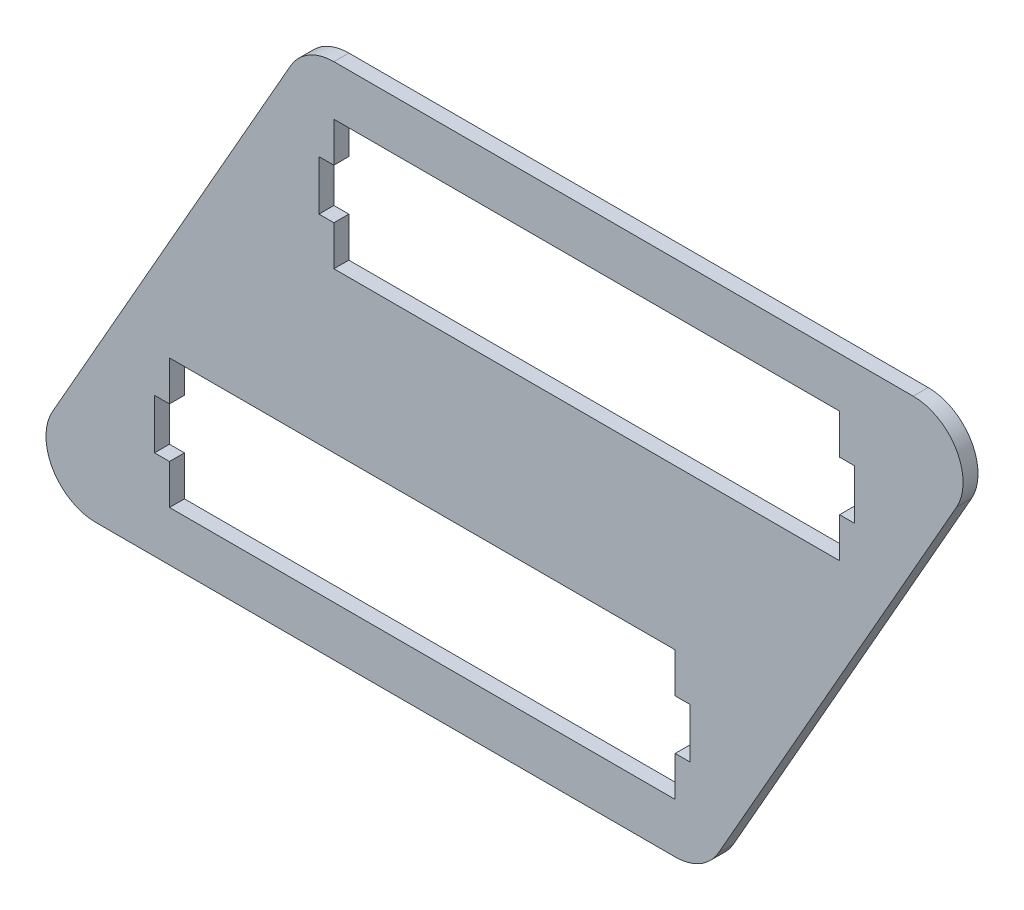
ISO-10303-21;
HEADER;
FILE_DESCRIPTION(('STEP AP214'),'2;1');
FILE_NAME('part.step','',(''),(''),'','','');
FILE_SCHEMA(('AUTOMOTIVE_DESIGN { 1 0 10303 214 1 1 1 1 }'));
ENDSEC;
DATA;
#1=APPLICATION_CONTEXT('core data for automotive mechanical design processes');
#2=APPLICATION_PROTOCOL_DEFINITION('international standard','automotive_design',2000,#1);
#3=PRODUCT_CONTEXT('',#1,'mechanical');
#4=PRODUCT('Part','Part','',(#3));
#5=PRODUCT_RELATED_PRODUCT_CATEGORY('part','',(#4));
#6=PRODUCT_DEFINITION_FORMATION('','',#4);
#7=PRODUCT_DEFINITION_CONTEXT('part definition',#1,'design');
#8=PRODUCT_DEFINITION('design','',#6,#7);
#9=PRODUCT_DEFINITION_SHAPE('','',#8);
#10=(LENGTH_UNIT() NAMED_UNIT(*) SI_UNIT(.MILLI.,.METRE.));
#11=(NAMED_UNIT(*) PLANE_ANGLE_UNIT() SI_UNIT($,.RADIAN.));
#12=(NAMED_UNIT(*) SI_UNIT($,.STERADIAN.) SOLID_ANGLE_UNIT());
#13=UNCERTAINTY_MEASURE_WITH_UNIT(LENGTH_MEASURE(1.E-05),#10,'distance_accuracy_value','');
#14=(GEOMETRIC_REPRESENTATION_CONTEXT(3) GLOBAL_UNCERTAINTY_ASSIGNED_CONTEXT((#13)) GLOBAL_UNIT_ASSIGNED_CONTEXT((#10,
#11,#12)) REPRESENTATION_CONTEXT('',''));
#15=CARTESIAN_POINT('',(0.,0.,0.));
#16=DIRECTION('',(0.,0.,1.));
#17=DIRECTION('',(1.,0.,0.));
#18=AXIS2_PLACEMENT_3D('',#15,#16,#17);
#19=CARTESIAN_POINT('',(133.488069393588,10.0000000000001,3.));
#20=DIRECTION('',(-1.,0.,0.));
#21=DIRECTION('',(0.,0.,1.));
#22=AXIS2_PLACEMENT_3D('',#19,#20,#21);
#23=PLANE('',#22);
#24=DIRECTION('',(0.,0.,1.));
#25=VECTOR('',#24,1.);
#26=CARTESIAN_POINT('',(133.488069393588,28.0000000000001,-0.00100000000000013));
#27=LINE('',#26,#25);
#28=CARTESIAN_POINT('',(133.488069393588,28.0000000000001,0.));
#29=VERTEX_POINT('',#28);
#30=CARTESIAN_POINT('',(133.488069393588,28.0000000000001,3.));
#31=VERTEX_POINT('',#30);
#32=EDGE_CURVE('E240',#29,#31,#27,.T.);
#33=ORIENTED_EDGE('',*,*,#32,.T.);
#34=DIRECTION('',(0.,1.,0.));
#35=VECTOR('',#34,1.);
#36=CARTESIAN_POINT('',(133.488069393588,10.0000000000001,3.));
#37=LINE('',#36,#35);
#38=CARTESIAN_POINT('',(133.488069393588,36.0000000000001,3.));
#39=VERTEX_POINT('',#38);
#40=EDGE_CURVE('E477',#31,#39,#37,.T.);
#41=ORIENTED_EDGE('',*,*,#40,.T.);
#42=DIRECTION('',(0.,0.,-1.));
#43=VECTOR('',#42,1.);
#44=CARTESIAN_POINT('',(133.488069393588,36.0000000000001,3.));
#45=LINE('',#44,#43);
#46=CARTESIAN_POINT('',(133.488069393588,36.0000000000001,0.));
#47=VERTEX_POINT('',#46);
#48=EDGE_CURVE('E262',#39,#47,#45,.T.);
#49=ORIENTED_EDGE('',*,*,#48,.T.);
#50=DIRECTION('',(0.,1.,0.));
#51=VECTOR('',#50,1.);
#52=CARTESIAN_POINT('',(133.488069393588,10.0000000000001,0.));
#53=LINE('',#52,#51);
#54=EDGE_CURVE('E256',#29,#47,#53,.T.);
#55=ORIENTED_EDGE('',*,*,#54,.F.);
#56=EDGE_LOOP('',(#33,#41,#49,#55));
#57=FACE_BOUND('',#56,.T.);
#58=ADVANCED_FACE('F32',(#57),#23,.T.);
#59=CARTESIAN_POINT('',(31.9880693935882,10.,3.));
#60=DIRECTION('',(1.,0.,0.));
#61=DIRECTION('',(0.,1.,0.));
#62=AXIS2_PLACEMENT_3D('',#59,#60,#61);
#63=PLANE('',#62);
#64=DIRECTION('',(0.,0.,1.));
#65=VECTOR('',#64,1.);
#66=CARTESIAN_POINT('',(31.9880693935882,18.,-0.00100000000000013));
#67=LINE('',#66,#65);
#68=CARTESIAN_POINT('',(31.9880693935882,18.,0.));
#69=VERTEX_POINT('',#68);
#70=CARTESIAN_POINT('',(31.9880693935882,18.,3.));
#71=VERTEX_POINT('',#70);
#72=EDGE_CURVE('E465',#69,#71,#67,.T.);
#73=ORIENTED_EDGE('',*,*,#72,.T.);
#74=DIRECTION('',(0.,-1.,0.));
#75=VECTOR('',#74,1.);
#76=CARTESIAN_POINT('',(31.9880693935882,10.,3.));
#77=LINE('',#76,#75);
#78=CARTESIAN_POINT('',(31.9880693935882,10.,3.));
#79=VERTEX_POINT('',#78);
#80=EDGE_CURVE('E275',#71,#79,#77,.T.);
#81=ORIENTED_EDGE('',*,*,#80,.T.);
#82=DIRECTION('',(0.,0.,-1.));
#83=VECTOR('',#82,1.);
#84=CARTESIAN_POINT('',(31.9880693935882,10.,3.));
#85=LINE('',#84,#83);
#86=CARTESIAN_POINT('',(31.9880693935882,10.,0.));
#87=VERTEX_POINT('',#86);
#88=EDGE_CURVE('E283',#79,#87,#85,.T.);
#89=ORIENTED_EDGE('',*,*,#88,.T.);
#90=DIRECTION('',(0.,-1.,0.));
#91=VECTOR('',#90,1.);
#92=CARTESIAN_POINT('',(31.9880693935882,10.,0.));
#93=LINE('',#92,#91);
#94=EDGE_CURVE('E460',#69,#87,#93,.T.);
#95=ORIENTED_EDGE('',*,*,#94,.F.);
#96=EDGE_LOOP('',(#73,#81,#89,#95));
#97=FACE_BOUND('',#96,.T.);
#98=ADVANCED_FACE('F426',(#97),#63,.T.);
#99=CARTESIAN_POINT('',(166.488069393588,68.0000000000001,3.));
#100=DIRECTION('',(-1.,0.,0.));
#101=DIRECTION('',(0.,0.,1.));
#102=AXIS2_PLACEMENT_3D('',#99,#100,#101);
#103=PLANE('',#102);
#104=DIRECTION('',(0.,0.,1.));
#105=VECTOR('',#104,1.);
#106=CARTESIAN_POINT('',(166.488069393588,86.,-0.00100000000000013));
#107=LINE('',#106,#105);
#108=CARTESIAN_POINT('',(166.488069393588,86.,0.));
#109=VERTEX_POINT('',#108);
#110=CARTESIAN_POINT('',(166.488069393588,86.,3.));
#111=VERTEX_POINT('',#110);
#112=EDGE_CURVE('E514',#109,#111,#107,.T.);
#113=ORIENTED_EDGE('',*,*,#112,.T.);
#114=DIRECTION('',(0.,1.,0.));
#115=VECTOR('',#114,1.);
#116=CARTESIAN_POINT('',(166.488069393588,68.0000000000001,3.));
#117=LINE('',#116,#115);
#118=CARTESIAN_POINT('',(166.488069393588,94.0000000000001,3.));
#119=VERTEX_POINT('',#118);
#120=EDGE_CURVE('E293',#111,#119,#117,.T.);
#121=ORIENTED_EDGE('',*,*,#120,.T.);
#122=DIRECTION('',(0.,0.,-1.));
#123=VECTOR('',#122,1.);
#124=CARTESIAN_POINT('',(166.488069393588,94.0000000000001,3.));
#125=LINE('',#124,#123);
#126=CARTESIAN_POINT('',(166.488069393588,94.0000000000001,0.));
#127=VERTEX_POINT('',#126);
#128=EDGE_CURVE('E315',#119,#127,#125,.T.);
#129=ORIENTED_EDGE('',*,*,#128,.T.);
#130=DIRECTION('',(0.,1.,0.));
#131=VECTOR('',#130,1.);
#132=CARTESIAN_POINT('',(166.488069393588,68.0000000000001,0.));
#133=LINE('',#132,#131);
#134=EDGE_CURVE('E306',#109,#127,#133,.T.);
#135=ORIENTED_EDGE('',*,*,#134,.F.);
#136=EDGE_LOOP('',(#113,#121,#129,#135));
#137=FACE_BOUND('',#136,.T.);
#138=ADVANCED_FACE('F432',(#137),#103,.T.);
#139=CARTESIAN_POINT('',(64.9880693935882,68.,3.));
#140=DIRECTION('',(1.,0.,0.));
#141=DIRECTION('',(0.,0.,-1.));
#142=AXIS2_PLACEMENT_3D('',#139,#140,#141);
#143=PLANE('',#142);
#144=DIRECTION('',(0.,0.,1.));
#145=VECTOR('',#144,1.);
#146=CARTESIAN_POINT('',(64.9880693935882,76.,-0.00100000000000013));
#147=LINE('',#146,#145);
#148=CARTESIAN_POINT('',(64.9880693935882,76.,0.));
#149=VERTEX_POINT('',#148);
#150=CARTESIAN_POINT('',(64.9880693935882,76.,3.));
#151=VERTEX_POINT('',#150);
#152=EDGE_CURVE('E480',#149,#151,#147,.T.);
#153=ORIENTED_EDGE('',*,*,#152,.T.);
#154=DIRECTION('',(0.,-1.,0.));
#155=VECTOR('',#154,1.);
#156=CARTESIAN_POINT('',(64.9880693935882,68.,3.));
#157=LINE('',#156,#155);
#158=CARTESIAN_POINT('',(64.9880693935882,68.,3.));
#159=VERTEX_POINT('',#158);
#160=EDGE_CURVE('E291',#151,#159,#157,.T.);
#161=ORIENTED_EDGE('',*,*,#160,.T.);
#162=DIRECTION('',(0.,0.,-1.));
#163=VECTOR('',#162,1.);
#164=CARTESIAN_POINT('',(64.9880693935882,68.,3.));
#165=LINE('',#164,#163);
#166=CARTESIAN_POINT('',(64.9880693935882,68.,0.));
#167=VERTEX_POINT('',#166);
#168=EDGE_CURVE('E320',#159,#167,#165,.T.);
#169=ORIENTED_EDGE('',*,*,#168,.T.);
#170=DIRECTION('',(0.,-1.,0.));
#171=VECTOR('',#170,1.);
#172=CARTESIAN_POINT('',(64.9880693935882,68.,0.));
#173=LINE('',#172,#171);
#174=EDGE_CURVE('E286',#149,#167,#173,.T.);
#175=ORIENTED_EDGE('',*,*,#174,.F.);
#176=EDGE_LOOP('',(#153,#161,#169,#175));
#177=FACE_BOUND('',#176,.T.);
#178=ADVANCED_FACE('F701',(#177),#143,.T.);
#179=CARTESIAN_POINT('',(0.,0.,3.));
#180=DIRECTION('',(0.,0.,1.));
#181=DIRECTION('',(1.,0.,0.));
#182=AXIS2_PLACEMENT_3D('',#179,#180,#181);
#183=PLANE('',#182);
#184=DIRECTION('',(-1.,0.,0.));
#185=VECTOR('',#184,1.);
#186=CARTESIAN_POINT('',(136.488069393588,28.,3.));
#187=LINE('',#186,#185);
#188=CARTESIAN_POINT('',(136.488069393588,28.,3.));
#189=VERTEX_POINT('',#188);
#190=EDGE_CURVE('E246',#189,#31,#187,.T.);
#191=ORIENTED_EDGE('',*,*,#190,.F.);
#192=DIRECTION('',(0.,1.,0.));
#193=VECTOR('',#192,1.);
#194=CARTESIAN_POINT('',(136.488069393588,18.,3.));
#195=LINE('',#194,#193);
#196=CARTESIAN_POINT('',(136.488069393588,18.,3.));
#197=VERTEX_POINT('',#196);
#198=EDGE_CURVE('E251',#197,#189,#195,.T.);
#199=ORIENTED_EDGE('',*,*,#198,.F.);
#200=DIRECTION('',(1.,0.,0.));
#201=VECTOR('',#200,1.);
#202=CARTESIAN_POINT('',(133.488069393588,18.,3.));
#203=LINE('',#202,#201);
#204=CARTESIAN_POINT('',(133.488069393588,18.,3.));
#205=VERTEX_POINT('',#204);
#206=EDGE_CURVE('E565',#205,#197,#203,.T.);
#207=ORIENTED_EDGE('',*,*,#206,.F.);
#208=CARTESIAN_POINT('',(133.488069393588,10.0000000000001,3.));
#209=VERTEX_POINT('',#208);
#210=EDGE_CURVE('E452',#209,#205,#37,.T.);
#211=ORIENTED_EDGE('',*,*,#210,.F.);
#212=DIRECTION('',(1.,0.,0.));
#213=VECTOR('',#212,1.);
#214=CARTESIAN_POINT('',(133.488069393588,10.0000000000001,3.));
#215=LINE('',#214,#213);
#216=EDGE_CURVE('E471',#79,#209,#215,.T.);
#217=ORIENTED_EDGE('',*,*,#216,.F.);
#218=ORIENTED_EDGE('',*,*,#80,.F.);
#219=DIRECTION('',(1.,0.,0.));
#220=VECTOR('',#219,1.);
#221=CARTESIAN_POINT('',(31.9880693935882,18.,3.));
#222=LINE('',#221,#220);
#223=CARTESIAN_POINT('',(28.9880693935882,18.,3.));
#224=VERTEX_POINT('',#223);
#225=EDGE_CURVE('E542',#224,#71,#222,.T.);
#226=ORIENTED_EDGE('',*,*,#225,.F.);
#227=DIRECTION('',(0.,-1.,0.));
#228=VECTOR('',#227,1.);
#229=CARTESIAN_POINT('',(28.9880693935882,18.,3.));
#230=LINE('',#229,#228);
#231=CARTESIAN_POINT('',(28.9880693935882,28.,3.));
#232=VERTEX_POINT('',#231);
#233=EDGE_CURVE('E548',#232,#224,#230,.T.);
#234=ORIENTED_EDGE('',*,*,#233,.F.);
#235=DIRECTION('',(-1.,0.,0.));
#236=VECTOR('',#235,1.);
#237=CARTESIAN_POINT('',(28.9880693935882,28.,3.));
#238=LINE('',#237,#236);
#239=CARTESIAN_POINT('',(31.9880693935882,28.0000000000001,3.));
#240=VERTEX_POINT('',#239);
#241=EDGE_CURVE('E551',#240,#232,#238,.T.);
#242=ORIENTED_EDGE('',*,*,#241,.F.);
#243=CARTESIAN_POINT('',(31.9880693935882,36.,3.));
#244=VERTEX_POINT('',#243);
#245=EDGE_CURVE('E468',#244,#240,#77,.T.);
#246=ORIENTED_EDGE('',*,*,#245,.F.);
#247=DIRECTION('',(-1.,0.,0.));
#248=VECTOR('',#247,1.);
#249=CARTESIAN_POINT('',(133.488069393588,36.0000000000001,3.));
#250=LINE('',#249,#248);
#251=EDGE_CURVE('E279',#39,#244,#250,.T.);
#252=ORIENTED_EDGE('',*,*,#251,.F.);
#253=ORIENTED_EDGE('',*,*,#40,.F.);
#254=EDGE_LOOP('',(#191,#199,#207,#211,#217,#218,#226,#234,#242,#246,#252,#253));
#255=FACE_BOUND('',#254,.T.);
#256=DIRECTION('',(-1.,0.,0.));
#257=VECTOR('',#256,1.);
#258=CARTESIAN_POINT('',(169.488069393588,86.,3.));
#259=LINE('',#258,#257);
#260=CARTESIAN_POINT('',(169.488069393588,86.,3.));
#261=VERTEX_POINT('',#260);
#262=EDGE_CURVE('E528',#261,#111,#259,.T.);
#263=ORIENTED_EDGE('',*,*,#262,.F.);
#264=DIRECTION('',(0.,1.,0.));
#265=VECTOR('',#264,1.);
#266=CARTESIAN_POINT('',(169.488069393588,76.,3.));
#267=LINE('',#266,#265);
#268=CARTESIAN_POINT('',(169.488069393588,76.,3.));
#269=VERTEX_POINT('',#268);
#270=EDGE_CURVE('E518',#269,#261,#267,.T.);
#271=ORIENTED_EDGE('',*,*,#270,.F.);
#272=DIRECTION('',(1.,0.,0.));
#273=VECTOR('',#272,1.);
#274=CARTESIAN_POINT('',(166.488069393588,76.,3.));
#275=LINE('',#274,#273);
#276=CARTESIAN_POINT('',(166.488069393588,76.,3.));
#277=VERTEX_POINT('',#276);
#278=EDGE_CURVE('E525',#277,#269,#275,.T.);
#279=ORIENTED_EDGE('',*,*,#278,.F.);
#280=CARTESIAN_POINT('',(166.488069393588,68.0000000000001,3.));
#281=VERTEX_POINT('',#280);
#282=EDGE_CURVE('E294',#281,#277,#117,.T.);
#283=ORIENTED_EDGE('',*,*,#282,.F.);
#284=DIRECTION('',(1.,0.,0.));
#285=VECTOR('',#284,1.);
#286=CARTESIAN_POINT('',(166.488069393588,68.0000000000001,3.));
#287=LINE('',#286,#285);
#288=EDGE_CURVE('E290',#159,#281,#287,.T.);
#289=ORIENTED_EDGE('',*,*,#288,.F.);
#290=ORIENTED_EDGE('',*,*,#160,.F.);
#291=DIRECTION('',(1.,0.,0.));
#292=VECTOR('',#291,1.);
#293=CARTESIAN_POINT('',(64.9880693935882,76.,3.));
#294=LINE('',#293,#292);
#295=CARTESIAN_POINT('',(61.9880693935882,76.,3.));
#296=VERTEX_POINT('',#295);
#297=EDGE_CURVE('E493',#296,#151,#294,.T.);
#298=ORIENTED_EDGE('',*,*,#297,.F.);
#299=DIRECTION('',(0.,-1.,0.));
#300=VECTOR('',#299,1.);
#301=CARTESIAN_POINT('',(61.9880693935882,76.,3.));
#302=LINE('',#301,#300);
#303=CARTESIAN_POINT('',(61.9880693935882,86.,3.));
#304=VERTEX_POINT('',#303);
#305=EDGE_CURVE('E499',#304,#296,#302,.T.);
#306=ORIENTED_EDGE('',*,*,#305,.F.);
#307=DIRECTION('',(-1.,0.,0.));
#308=VECTOR('',#307,1.);
#309=CARTESIAN_POINT('',(61.9880693935882,86.,3.));
#310=LINE('',#309,#308);
#311=CARTESIAN_POINT('',(64.9880693935882,86.,3.));
#312=VERTEX_POINT('',#311);
#313=EDGE_CURVE('E502',#312,#304,#310,.T.);
#314=ORIENTED_EDGE('',*,*,#313,.F.);
#315=CARTESIAN_POINT('',(64.9880693935882,94.,3.));
#316=VERTEX_POINT('',#315);
#317=EDGE_CURVE('E287',#316,#312,#157,.T.);
#318=ORIENTED_EDGE('',*,*,#317,.F.);
#319=DIRECTION('',(-1.,0.,0.));
#320=VECTOR('',#319,1.);
#321=CARTESIAN_POINT('',(166.488069393588,94.0000000000001,3.));
#322=LINE('',#321,#320);
#323=EDGE_CURVE('E297',#119,#316,#322,.T.);
#324=ORIENTED_EDGE('',*,*,#323,.F.);
#325=ORIENTED_EDGE('',*,*,#120,.F.);
#326=EDGE_LOOP('',(#263,#271,#279,#283,#289,#290,#298,#306,#314,#318,#324,#325));
#327=FACE_BOUND('',#326,.T.);
#328=DIRECTION('',(-0.494524249255059,-0.869163832024044,0.));
#329=VECTOR('',#328,1.);
#330=CARTESIAN_POINT('',(0.,0.,3.));
#331=LINE('',#330,#329);
#332=CARTESIAN_POINT('',(56.2964310733478,98.9452424925506,3.));
#333=VERTEX_POINT('',#332);
#334=CARTESIAN_POINT('',(8.50332762507188,14.9452424925506,3.));
#335=VERTEX_POINT('',#334);
#336=EDGE_CURVE('E334',#333,#335,#331,.T.);
#337=ORIENTED_EDGE('',*,*,#336,.T.);
#338=CARTESIAN_POINT('',(17.1949659453123,10.,3.));
#339=DIRECTION('',(0.,0.,1.));
#340=DIRECTION('',(1.,0.,0.));
#341=AXIS2_PLACEMENT_3D('',#338,#339,#340);
#342=CIRCLE('',#341,10.);
#343=CARTESIAN_POINT('',(17.1949659453123,0.,3.));
#344=VERTEX_POINT('',#343);
#345=EDGE_CURVE('E371',#335,#344,#342,.T.);
#346=ORIENTED_EDGE('',*,*,#345,.T.);
#347=DIRECTION('',(1.,0.,0.));
#348=VECTOR('',#347,1.);
#349=CARTESIAN_POINT('',(0.,0.,3.));
#350=LINE('',#349,#348);
#351=CARTESIAN_POINT('',(133.488069393588,0.,3.));
#352=VERTEX_POINT('',#351);
#353=EDGE_CURVE('E324',#344,#352,#350,.T.);
#354=ORIENTED_EDGE('',*,*,#353,.T.);
#355=CARTESIAN_POINT('',(133.488069393588,10.,3.));
#356=DIRECTION('',(0.,0.,1.));
#357=DIRECTION('',(1.,0.,0.));
#358=AXIS2_PLACEMENT_3D('',#355,#356,#357);
#359=CIRCLE('',#358,10.);
#360=CARTESIAN_POINT('',(142.179707713829,5.0547575074494,3.));
#361=VERTEX_POINT('',#360);
#362=EDGE_CURVE('E369',#352,#361,#359,.T.);
#363=ORIENTED_EDGE('',*,*,#362,.T.);
#364=DIRECTION('',(0.494524249255059,0.869163832024043,0.));
#365=VECTOR('',#364,1.);
#366=CARTESIAN_POINT('',(139.303724994073,0.,3.));
#367=LINE('',#366,#365);
#368=CARTESIAN_POINT('',(189.972811162105,89.0547575074494,3.));
#369=VERTEX_POINT('',#368);
#370=EDGE_CURVE('E327',#361,#369,#367,.T.);
#371=ORIENTED_EDGE('',*,*,#370,.T.);
#372=CARTESIAN_POINT('',(181.281172841864,94.0000000000001,3.));
#373=DIRECTION('',(0.,0.,1.));
#374=DIRECTION('',(1.,0.,0.));
#375=AXIS2_PLACEMENT_3D('',#372,#373,#374);
#376=CIRCLE('',#375,10.);
#377=CARTESIAN_POINT('',(181.281172841864,104.,3.));
#378=VERTEX_POINT('',#377);
#379=EDGE_CURVE('E365',#369,#378,#376,.T.);
#380=ORIENTED_EDGE('',*,*,#379,.T.);
#381=DIRECTION('',(-1.,0.,0.));
#382=VECTOR('',#381,1.);
#383=CARTESIAN_POINT('',(59.1724137931035,104.,3.));
#384=LINE('',#383,#382);
#385=CARTESIAN_POINT('',(64.9880693935882,104.,3.));
#386=VERTEX_POINT('',#385);
#387=EDGE_CURVE('E331',#378,#386,#384,.T.);
#388=ORIENTED_EDGE('',*,*,#387,.T.);
#389=CARTESIAN_POINT('',(64.9880693935882,94.0000000000001,3.));
#390=DIRECTION('',(0.,0.,1.));
#391=DIRECTION('',(1.,0.,0.));
#392=AXIS2_PLACEMENT_3D('',#389,#390,#391);
#393=CIRCLE('',#392,10.);
#394=EDGE_CURVE('E367',#386,#333,#393,.T.);
#395=ORIENTED_EDGE('',*,*,#394,.T.);
#396=EDGE_LOOP('',(#337,#346,#354,#363,#371,#380,#388,#395));
#397=FACE_BOUND('',#396,.T.);
#398=ADVANCED_FACE('F400',(#255,#327,#397),#183,.T.);
#399=CARTESIAN_POINT('',(0.,0.,0.));
#400=DIRECTION('',(0.,0.,1.));
#401=DIRECTION('',(1.,0.,0.));
#402=AXIS2_PLACEMENT_3D('',#399,#400,#401);
#403=PLANE('',#402);
#404=DIRECTION('',(0.,-1.,0.));
#405=VECTOR('',#404,1.);
#406=CARTESIAN_POINT('',(169.488069393588,76.,0.));
#407=LINE('',#406,#405);
#408=CARTESIAN_POINT('',(169.488069393588,86.,0.));
#409=VERTEX_POINT('',#408);
#410=CARTESIAN_POINT('',(169.488069393588,76.,0.));
#411=VERTEX_POINT('',#410);
#412=EDGE_CURVE('E533',#409,#411,#407,.T.);
#413=ORIENTED_EDGE('',*,*,#412,.F.);
#414=DIRECTION('',(1.,0.,0.));
#415=VECTOR('',#414,1.);
#416=CARTESIAN_POINT('',(169.488069393588,86.,0.));
#417=LINE('',#416,#415);
#418=EDGE_CURVE('E530',#109,#409,#417,.T.);
#419=ORIENTED_EDGE('',*,*,#418,.F.);
#420=ORIENTED_EDGE('',*,*,#134,.T.);
#421=DIRECTION('',(-1.,0.,0.));
#422=VECTOR('',#421,1.);
#423=CARTESIAN_POINT('',(166.488069393588,94.0000000000001,0.));
#424=LINE('',#423,#422);
#425=CARTESIAN_POINT('',(64.9880693935882,94.,0.));
#426=VERTEX_POINT('',#425);
#427=EDGE_CURVE('E310',#127,#426,#424,.T.);
#428=ORIENTED_EDGE('',*,*,#427,.T.);
#429=CARTESIAN_POINT('',(64.9880693935882,86.,0.));
#430=VERTEX_POINT('',#429);
#431=EDGE_CURVE('E300',#426,#430,#173,.T.);
#432=ORIENTED_EDGE('',*,*,#431,.T.);
#433=DIRECTION('',(1.,0.,0.));
#434=VECTOR('',#433,1.);
#435=CARTESIAN_POINT('',(61.9880693935882,86.,0.));
#436=LINE('',#435,#434);
#437=CARTESIAN_POINT('',(61.9880693935882,86.,0.));
#438=VERTEX_POINT('',#437);
#439=EDGE_CURVE('E474',#438,#430,#436,.T.);
#440=ORIENTED_EDGE('',*,*,#439,.F.);
#441=DIRECTION('',(0.,1.,0.));
#442=VECTOR('',#441,1.);
#443=CARTESIAN_POINT('',(61.9880693935882,76.,0.));
#444=LINE('',#443,#442);
#445=CARTESIAN_POINT('',(61.9880693935882,76.,0.));
#446=VERTEX_POINT('',#445);
#447=EDGE_CURVE('E510',#446,#438,#444,.T.);
#448=ORIENTED_EDGE('',*,*,#447,.F.);
#449=DIRECTION('',(-1.,0.,0.));
#450=VECTOR('',#449,1.);
#451=CARTESIAN_POINT('',(64.9880693935882,76.,0.));
#452=LINE('',#451,#450);
#453=EDGE_CURVE('E505',#149,#446,#452,.T.);
#454=ORIENTED_EDGE('',*,*,#453,.F.);
#455=ORIENTED_EDGE('',*,*,#174,.T.);
#456=DIRECTION('',(1.,0.,0.));
#457=VECTOR('',#456,1.);
#458=CARTESIAN_POINT('',(166.488069393588,68.0000000000001,0.));
#459=LINE('',#458,#457);
#460=CARTESIAN_POINT('',(166.488069393588,68.0000000000001,0.));
#461=VERTEX_POINT('',#460);
#462=EDGE_CURVE('E303',#167,#461,#459,.T.);
#463=ORIENTED_EDGE('',*,*,#462,.T.);
#464=CARTESIAN_POINT('',(166.488069393588,76.,0.));
#465=VERTEX_POINT('',#464);
#466=EDGE_CURVE('E307',#461,#465,#133,.T.);
#467=ORIENTED_EDGE('',*,*,#466,.T.);
#468=DIRECTION('',(-1.,0.,0.));
#469=VECTOR('',#468,1.);
#470=CARTESIAN_POINT('',(166.488069393588,76.,0.));
#471=LINE('',#470,#469);
#472=EDGE_CURVE('E536',#411,#465,#471,.T.);
#473=ORIENTED_EDGE('',*,*,#472,.F.);
#474=EDGE_LOOP('',(#413,#419,#420,#428,#432,#440,#448,#454,#455,#463,#467,#473));
#475=FACE_BOUND('',#474,.T.);
#476=DIRECTION('',(1.,0.,0.));
#477=VECTOR('',#476,1.);
#478=CARTESIAN_POINT('',(0.,0.,0.));
#479=LINE('',#478,#477);
#480=CARTESIAN_POINT('',(17.1949659453123,0.,0.));
#481=VERTEX_POINT('',#480);
#482=CARTESIAN_POINT('',(133.488069393588,0.,0.));
#483=VERTEX_POINT('',#482);
#484=EDGE_CURVE('E323',#481,#483,#479,.T.);
#485=ORIENTED_EDGE('',*,*,#484,.F.);
#486=CARTESIAN_POINT('',(17.1949659453123,10.,0.));
#487=DIRECTION('',(0.,0.,1.));
#488=DIRECTION('',(1.,0.,0.));
#489=AXIS2_PLACEMENT_3D('',#486,#487,#488);
#490=CIRCLE('',#489,10.);
#491=CARTESIAN_POINT('',(8.50332762507188,14.9452424925506,0.));
#492=VERTEX_POINT('',#491);
#493=EDGE_CURVE('E358',#481,#492,#490,.F.);
#494=ORIENTED_EDGE('',*,*,#493,.T.);
#495=DIRECTION('',(-0.494524249255059,-0.869163832024044,0.));
#496=VECTOR('',#495,1.);
#497=CARTESIAN_POINT('',(0.,0.,0.));
#498=LINE('',#497,#496);
#499=CARTESIAN_POINT('',(56.2964310733478,98.9452424925506,0.));
#500=VERTEX_POINT('',#499);
#501=EDGE_CURVE('E328',#500,#492,#498,.T.);
#502=ORIENTED_EDGE('',*,*,#501,.F.);
#503=CARTESIAN_POINT('',(64.9880693935882,94.0000000000001,0.));
#504=DIRECTION('',(0.,0.,1.));
#505=DIRECTION('',(1.,0.,0.));
#506=AXIS2_PLACEMENT_3D('',#503,#504,#505);
#507=CIRCLE('',#506,10.);
#508=CARTESIAN_POINT('',(64.9880693935882,104.,0.));
#509=VERTEX_POINT('',#508);
#510=EDGE_CURVE('E354',#500,#509,#507,.F.);
#511=ORIENTED_EDGE('',*,*,#510,.T.);
#512=DIRECTION('',(-1.,0.,0.));
#513=VECTOR('',#512,1.);
#514=CARTESIAN_POINT('',(59.1724137931035,104.,0.));
#515=LINE('',#514,#513);
#516=CARTESIAN_POINT('',(181.281172841864,104.,0.));
#517=VERTEX_POINT('',#516);
#518=EDGE_CURVE('E343',#517,#509,#515,.T.);
#519=ORIENTED_EDGE('',*,*,#518,.F.);
#520=CARTESIAN_POINT('',(181.281172841864,94.0000000000001,0.));
#521=DIRECTION('',(0.,0.,1.));
#522=DIRECTION('',(1.,0.,0.));
#523=AXIS2_PLACEMENT_3D('',#520,#521,#522);
#524=CIRCLE('',#523,10.);
#525=CARTESIAN_POINT('',(189.972811162105,89.0547575074494,0.));
#526=VERTEX_POINT('',#525);
#527=EDGE_CURVE('E352',#517,#526,#524,.F.);
#528=ORIENTED_EDGE('',*,*,#527,.T.);
#529=DIRECTION('',(0.494524249255059,0.869163832024043,0.));
#530=VECTOR('',#529,1.);
#531=CARTESIAN_POINT('',(139.303724994073,0.,0.));
#532=LINE('',#531,#530);
#533=CARTESIAN_POINT('',(142.179707713829,5.0547575074494,0.));
#534=VERTEX_POINT('',#533);
#535=EDGE_CURVE('E340',#534,#526,#532,.T.);
#536=ORIENTED_EDGE('',*,*,#535,.F.);
#537=CARTESIAN_POINT('',(133.488069393588,10.,0.));
#538=DIRECTION('',(0.,0.,1.));
#539=DIRECTION('',(1.,0.,0.));
#540=AXIS2_PLACEMENT_3D('',#537,#538,#539);
#541=CIRCLE('',#540,10.);
#542=EDGE_CURVE('E356',#534,#483,#541,.F.);
#543=ORIENTED_EDGE('',*,*,#542,.T.);
#544=EDGE_LOOP('',(#485,#494,#502,#511,#519,#528,#536,#543));
#545=FACE_BOUND('',#544,.T.);
#546=DIRECTION('',(0.,-1.,0.));
#547=VECTOR('',#546,1.);
#548=CARTESIAN_POINT('',(136.488069393588,18.,0.));
#549=LINE('',#548,#547);
#550=CARTESIAN_POINT('',(136.488069393588,28.,0.));
#551=VERTEX_POINT('',#550);
#552=CARTESIAN_POINT('',(136.488069393588,18.,0.));
#553=VERTEX_POINT('',#552);
#554=EDGE_CURVE('E259',#551,#553,#549,.T.);
#555=ORIENTED_EDGE('',*,*,#554,.F.);
#556=DIRECTION('',(1.,0.,0.));
#557=VECTOR('',#556,1.);
#558=CARTESIAN_POINT('',(136.488069393588,28.,0.));
#559=LINE('',#558,#557);
#560=EDGE_CURVE('E243',#29,#551,#559,.T.);
#561=ORIENTED_EDGE('',*,*,#560,.F.);
#562=ORIENTED_EDGE('',*,*,#54,.T.);
#563=DIRECTION('',(-1.,0.,0.));
#564=VECTOR('',#563,1.);
#565=CARTESIAN_POINT('',(133.488069393588,36.0000000000001,0.));
#566=LINE('',#565,#564);
#567=CARTESIAN_POINT('',(31.9880693935882,36.,0.));
#568=VERTEX_POINT('',#567);
#569=EDGE_CURVE('E268',#47,#568,#566,.T.);
#570=ORIENTED_EDGE('',*,*,#569,.T.);
#571=CARTESIAN_POINT('',(31.9880693935882,28.0000000000001,0.));
#572=VERTEX_POINT('',#571);
#573=EDGE_CURVE('E270',#568,#572,#93,.T.);
#574=ORIENTED_EDGE('',*,*,#573,.T.);
#575=DIRECTION('',(1.,0.,0.));
#576=VECTOR('',#575,1.);
#577=CARTESIAN_POINT('',(28.9880693935882,28.,0.));
#578=LINE('',#577,#576);
#579=CARTESIAN_POINT('',(28.9880693935882,28.,0.));
#580=VERTEX_POINT('',#579);
#581=EDGE_CURVE('E55',#580,#572,#578,.T.);
#582=ORIENTED_EDGE('',*,*,#581,.F.);
#583=DIRECTION('',(0.,1.,0.));
#584=VECTOR('',#583,1.);
#585=CARTESIAN_POINT('',(28.9880693935882,18.,0.));
#586=LINE('',#585,#584);
#587=CARTESIAN_POINT('',(28.9880693935882,18.,0.));
#588=VERTEX_POINT('',#587);
#589=EDGE_CURVE('E557',#588,#580,#586,.T.);
#590=ORIENTED_EDGE('',*,*,#589,.F.);
#591=DIRECTION('',(-1.,0.,0.));
#592=VECTOR('',#591,1.);
#593=CARTESIAN_POINT('',(31.9880693935882,18.,0.));
#594=LINE('',#593,#592);
#595=EDGE_CURVE('E554',#69,#588,#594,.T.);
#596=ORIENTED_EDGE('',*,*,#595,.F.);
#597=ORIENTED_EDGE('',*,*,#94,.T.);
#598=DIRECTION('',(1.,0.,0.));
#599=VECTOR('',#598,1.);
#600=CARTESIAN_POINT('',(133.488069393588,10.0000000000001,0.));
#601=LINE('',#600,#599);
#602=CARTESIAN_POINT('',(133.488069393588,10.0000000000001,0.));
#603=VERTEX_POINT('',#602);
#604=EDGE_CURVE('E265',#87,#603,#601,.T.);
#605=ORIENTED_EDGE('',*,*,#604,.T.);
#606=CARTESIAN_POINT('',(133.488069393588,18.,0.));
#607=VERTEX_POINT('',#606);
#608=EDGE_CURVE('E264',#603,#607,#53,.T.);
#609=ORIENTED_EDGE('',*,*,#608,.T.);
#610=DIRECTION('',(-1.,0.,0.));
#611=VECTOR('',#610,1.);
#612=CARTESIAN_POINT('',(133.488069393588,18.,0.));
#613=LINE('',#612,#611);
#614=EDGE_CURVE('E47',#553,#607,#613,.T.);
#615=ORIENTED_EDGE('',*,*,#614,.F.);
#616=EDGE_LOOP('',(#555,#561,#562,#570,#574,#582,#590,#596,#597,#605,#609,#615));
#617=FACE_BOUND('',#616,.T.);
#618=ADVANCED_FACE('F254',(#475,#545,#617),#403,.F.);
#619=CARTESIAN_POINT('',(0.,0.,3.));
#620=DIRECTION('',(0.,1.,0.));
#621=DIRECTION('',(-1.,0.,0.));
#622=AXIS2_PLACEMENT_3D('',#619,#620,#621);
#623=PLANE('',#622);
#624=ORIENTED_EDGE('',*,*,#353,.F.);
#625=DIRECTION('',(0.,0.,-1.));
#626=VECTOR('',#625,1.);
#627=CARTESIAN_POINT('',(17.1949659453123,0.,3.));
#628=LINE('',#627,#626);
#629=EDGE_CURVE('E349',#344,#481,#628,.T.);
#630=ORIENTED_EDGE('',*,*,#629,.T.);
#631=ORIENTED_EDGE('',*,*,#484,.T.);
#632=DIRECTION('',(0.,0.,-1.));
#633=VECTOR('',#632,1.);
#634=CARTESIAN_POINT('',(133.488069393588,0.,3.));
#635=LINE('',#634,#633);
#636=EDGE_CURVE('E337',#483,#352,#635,.F.);
#637=ORIENTED_EDGE('',*,*,#636,.T.);
#638=EDGE_LOOP('',(#624,#630,#631,#637));
#639=FACE_BOUND('',#638,.T.);
#640=ADVANCED_FACE('F406',(#639),#623,.F.);
#641=CARTESIAN_POINT('',(139.303724994073,0.,3.));
#642=DIRECTION('',(-0.869163832024044,0.494524249255059,0.));
#643=DIRECTION('',(-0.494524249255059,-0.869163832024044,0.));
#644=AXIS2_PLACEMENT_3D('',#641,#642,#643);
#645=PLANE('',#644);
#646=ORIENTED_EDGE('',*,*,#370,.F.);
#647=DIRECTION('',(0.,0.,-1.));
#648=VECTOR('',#647,1.);
#649=CARTESIAN_POINT('',(142.179707713829,5.05475750744941,3.));
#650=LINE('',#649,#648);
#651=EDGE_CURVE('E375',#361,#534,#650,.T.);
#652=ORIENTED_EDGE('',*,*,#651,.T.);
#653=ORIENTED_EDGE('',*,*,#535,.T.);
#654=DIRECTION('',(0.,0.,-1.));
#655=VECTOR('',#654,1.);
#656=CARTESIAN_POINT('',(189.972811162105,89.0547575074495,3.));
#657=LINE('',#656,#655);
#658=EDGE_CURVE('E373',#526,#369,#657,.F.);
#659=ORIENTED_EDGE('',*,*,#658,.T.);
#660=EDGE_LOOP('',(#646,#652,#653,#659));
#661=FACE_BOUND('',#660,.T.);
#662=ADVANCED_FACE('F414',(#661),#645,.F.);
#663=CARTESIAN_POINT('',(59.1724137931035,104.,3.));
#664=DIRECTION('',(0.,-1.,0.));
#665=DIRECTION('',(0.,0.,-1.));
#666=AXIS2_PLACEMENT_3D('',#663,#664,#665);
#667=PLANE('',#666);
#668=ORIENTED_EDGE('',*,*,#518,.T.);
#669=DIRECTION('',(0.,0.,-1.));
#670=VECTOR('',#669,1.);
#671=CARTESIAN_POINT('',(64.9880693935882,104.,3.));
#672=LINE('',#671,#670);
#673=EDGE_CURVE('E11',#509,#386,#672,.F.);
#674=ORIENTED_EDGE('',*,*,#673,.T.);
#675=ORIENTED_EDGE('',*,*,#387,.F.);
#676=DIRECTION('',(0.,0.,-1.));
#677=VECTOR('',#676,1.);
#678=CARTESIAN_POINT('',(181.281172841864,104.,3.));
#679=LINE('',#678,#677);
#680=EDGE_CURVE('E40',#378,#517,#679,.T.);
#681=ORIENTED_EDGE('',*,*,#680,.T.);
#682=EDGE_LOOP('',(#668,#674,#675,#681));
#683=FACE_BOUND('',#682,.T.);
#684=ADVANCED_FACE('F382',(#683),#667,.F.);
#685=CARTESIAN_POINT('',(0.,0.,3.));
#686=DIRECTION('',(0.869163832024044,-0.494524249255059,0.));
#687=DIRECTION('',(0.494524249255059,0.869163832024044,0.));
#688=AXIS2_PLACEMENT_3D('',#685,#686,#687);
#689=PLANE('',#688);
#690=ORIENTED_EDGE('',*,*,#501,.T.);
#691=DIRECTION('',(0.,0.,-1.));
#692=VECTOR('',#691,1.);
#693=CARTESIAN_POINT('',(8.50332762507189,14.9452424925506,3.));
#694=LINE('',#693,#692);
#695=EDGE_CURVE('E363',#492,#335,#694,.F.);
#696=ORIENTED_EDGE('',*,*,#695,.T.);
#697=ORIENTED_EDGE('',*,*,#336,.F.);
#698=DIRECTION('',(0.,0.,-1.));
#699=VECTOR('',#698,1.);
#700=CARTESIAN_POINT('',(56.2964310733478,98.9452424925506,3.));
#701=LINE('',#700,#699);
#702=EDGE_CURVE('E360',#333,#500,#701,.T.);
#703=ORIENTED_EDGE('',*,*,#702,.T.);
#704=EDGE_LOOP('',(#690,#696,#697,#703));
#705=FACE_BOUND('',#704,.T.);
#706=ADVANCED_FACE('F396',(#705),#689,.F.);
#707=DIRECTION('',(0.,0.,1.));
#708=VECTOR('',#707,1.);
#709=CARTESIAN_POINT('',(64.9880693935882,86.,-0.00100000000000013));
#710=LINE('',#709,#708);
#711=EDGE_CURVE('E496',#430,#312,#710,.T.);
#712=ORIENTED_EDGE('',*,*,#711,.F.);
#713=ORIENTED_EDGE('',*,*,#431,.F.);
#714=DIRECTION('',(0.,0.,-1.));
#715=VECTOR('',#714,1.);
#716=CARTESIAN_POINT('',(64.9880693935882,94.,3.));
#717=LINE('',#716,#715);
#718=EDGE_CURVE('E299',#316,#426,#717,.T.);
#719=ORIENTED_EDGE('',*,*,#718,.F.);
#720=ORIENTED_EDGE('',*,*,#317,.T.);
#721=EDGE_LOOP('',(#712,#713,#719,#720));
#722=FACE_BOUND('',#721,.T.);
#723=ADVANCED_FACE('F712',(#722),#143,.T.);
#724=CARTESIAN_POINT('',(166.488069393588,68.0000000000001,3.));
#725=DIRECTION('',(0.,1.,0.));
#726=DIRECTION('',(-1.,0.,0.));
#727=AXIS2_PLACEMENT_3D('',#724,#725,#726);
#728=PLANE('',#727);
#729=ORIENTED_EDGE('',*,*,#462,.F.);
#730=ORIENTED_EDGE('',*,*,#168,.F.);
#731=ORIENTED_EDGE('',*,*,#288,.T.);
#732=DIRECTION('',(0.,0.,-1.));
#733=VECTOR('',#732,1.);
#734=CARTESIAN_POINT('',(166.488069393588,68.0000000000001,3.));
#735=LINE('',#734,#733);
#736=EDGE_CURVE('E318',#281,#461,#735,.T.);
#737=ORIENTED_EDGE('',*,*,#736,.T.);
#738=EDGE_LOOP('',(#729,#730,#731,#737));
#739=FACE_BOUND('',#738,.T.);
#740=ADVANCED_FACE('F775',(#739),#728,.T.);
#741=DIRECTION('',(0.,0.,1.));
#742=VECTOR('',#741,1.);
#743=CARTESIAN_POINT('',(166.488069393588,76.,-0.00100000000000013));
#744=LINE('',#743,#742);
#745=EDGE_CURVE('E517',#465,#277,#744,.T.);
#746=ORIENTED_EDGE('',*,*,#745,.F.);
#747=ORIENTED_EDGE('',*,*,#466,.F.);
#748=ORIENTED_EDGE('',*,*,#736,.F.);
#749=ORIENTED_EDGE('',*,*,#282,.T.);
#750=EDGE_LOOP('',(#746,#747,#748,#749));
#751=FACE_BOUND('',#750,.T.);
#752=ADVANCED_FACE('F704',(#751),#103,.T.);
#753=CARTESIAN_POINT('',(166.488069393588,94.0000000000001,3.));
#754=DIRECTION('',(0.,-1.,0.));
#755=DIRECTION('',(1.,0.,0.));
#756=AXIS2_PLACEMENT_3D('',#753,#754,#755);
#757=PLANE('',#756);
#758=ORIENTED_EDGE('',*,*,#427,.F.);
#759=ORIENTED_EDGE('',*,*,#128,.F.);
#760=ORIENTED_EDGE('',*,*,#323,.T.);
#761=ORIENTED_EDGE('',*,*,#718,.T.);
#762=EDGE_LOOP('',(#758,#759,#760,#761));
#763=FACE_BOUND('',#762,.T.);
#764=ADVANCED_FACE('F760',(#763),#757,.T.);
#765=DIRECTION('',(0.,0.,1.));
#766=VECTOR('',#765,1.);
#767=CARTESIAN_POINT('',(31.9880693935882,28.0000000000001,-0.00100000000000013));
#768=LINE('',#767,#766);
#769=EDGE_CURVE('E539',#572,#240,#768,.T.);
#770=ORIENTED_EDGE('',*,*,#769,.F.);
#771=ORIENTED_EDGE('',*,*,#573,.F.);
#772=DIRECTION('',(0.,0.,-1.));
#773=VECTOR('',#772,1.);
#774=CARTESIAN_POINT('',(31.9880693935882,36.,3.));
#775=LINE('',#774,#773);
#776=EDGE_CURVE('E276',#244,#568,#775,.T.);
#777=ORIENTED_EDGE('',*,*,#776,.F.);
#778=ORIENTED_EDGE('',*,*,#245,.T.);
#779=EDGE_LOOP('',(#770,#771,#777,#778));
#780=FACE_BOUND('',#779,.T.);
#781=ADVANCED_FACE('F435',(#780),#63,.T.);
#782=CARTESIAN_POINT('',(133.488069393588,10.0000000000001,3.));
#783=DIRECTION('',(0.,1.,0.));
#784=DIRECTION('',(-1.,0.,0.));
#785=AXIS2_PLACEMENT_3D('',#782,#783,#784);
#786=PLANE('',#785);
#787=ORIENTED_EDGE('',*,*,#604,.F.);
#788=ORIENTED_EDGE('',*,*,#88,.F.);
#789=ORIENTED_EDGE('',*,*,#216,.T.);
#790=DIRECTION('',(0.,0.,-1.));
#791=VECTOR('',#790,1.);
#792=CARTESIAN_POINT('',(133.488069393588,10.0000000000001,3.));
#793=LINE('',#792,#791);
#794=EDGE_CURVE('E281',#209,#603,#793,.T.);
#795=ORIENTED_EDGE('',*,*,#794,.T.);
#796=EDGE_LOOP('',(#787,#788,#789,#795));
#797=FACE_BOUND('',#796,.T.);
#798=ADVANCED_FACE('F440',(#797),#786,.T.);
#799=DIRECTION('',(0.,0.,1.));
#800=VECTOR('',#799,1.);
#801=CARTESIAN_POINT('',(133.488069393588,18.,-0.00100000000000013));
#802=LINE('',#801,#800);
#803=EDGE_CURVE('E250',#607,#205,#802,.T.);
#804=ORIENTED_EDGE('',*,*,#803,.F.);
#805=ORIENTED_EDGE('',*,*,#608,.F.);
#806=ORIENTED_EDGE('',*,*,#794,.F.);
#807=ORIENTED_EDGE('',*,*,#210,.T.);
#808=EDGE_LOOP('',(#804,#805,#806,#807));
#809=FACE_BOUND('',#808,.T.);
#810=ADVANCED_FACE('F428',(#809),#23,.T.);
#811=CARTESIAN_POINT('',(133.488069393588,36.0000000000001,3.));
#812=DIRECTION('',(0.,-1.,0.));
#813=DIRECTION('',(1.,0.,0.));
#814=AXIS2_PLACEMENT_3D('',#811,#812,#813);
#815=PLANE('',#814);
#816=ORIENTED_EDGE('',*,*,#569,.F.);
#817=ORIENTED_EDGE('',*,*,#48,.F.);
#818=ORIENTED_EDGE('',*,*,#251,.T.);
#819=ORIENTED_EDGE('',*,*,#776,.T.);
#820=EDGE_LOOP('',(#816,#817,#818,#819));
#821=FACE_BOUND('',#820,.T.);
#822=ADVANCED_FACE('F439',(#821),#815,.T.);
#823=CARTESIAN_POINT('',(17.1949659453123,10.,3.));
#824=DIRECTION('',(0.,0.,-1.));
#825=DIRECTION('',(-1.,0.,0.));
#826=AXIS2_PLACEMENT_3D('',#823,#824,#825);
#827=CYLINDRICAL_SURFACE('',#826,10.);
#828=ORIENTED_EDGE('',*,*,#345,.F.);
#829=ORIENTED_EDGE('',*,*,#695,.F.);
#830=ORIENTED_EDGE('',*,*,#493,.F.);
#831=ORIENTED_EDGE('',*,*,#629,.F.);
#832=EDGE_LOOP('',(#828,#829,#830,#831));
#833=FACE_BOUND('',#832,.T.);
#834=ADVANCED_FACE('F404',(#833),#827,.T.);
#835=CARTESIAN_POINT('',(133.488069393588,10.,3.));
#836=DIRECTION('',(0.,0.,-1.));
#837=DIRECTION('',(-1.,0.,0.));
#838=AXIS2_PLACEMENT_3D('',#835,#836,#837);
#839=CYLINDRICAL_SURFACE('',#838,10.);
#840=ORIENTED_EDGE('',*,*,#362,.F.);
#841=ORIENTED_EDGE('',*,*,#636,.F.);
#842=ORIENTED_EDGE('',*,*,#542,.F.);
#843=ORIENTED_EDGE('',*,*,#651,.F.);
#844=EDGE_LOOP('',(#840,#841,#842,#843));
#845=FACE_BOUND('',#844,.T.);
#846=ADVANCED_FACE('F411',(#845),#839,.T.);
#847=CARTESIAN_POINT('',(64.9880693935882,94.0000000000001,3.));
#848=DIRECTION('',(0.,0.,-1.));
#849=DIRECTION('',(-1.,0.,0.));
#850=AXIS2_PLACEMENT_3D('',#847,#848,#849);
#851=CYLINDRICAL_SURFACE('',#850,10.);
#852=ORIENTED_EDGE('',*,*,#394,.F.);
#853=ORIENTED_EDGE('',*,*,#673,.F.);
#854=ORIENTED_EDGE('',*,*,#510,.F.);
#855=ORIENTED_EDGE('',*,*,#702,.F.);
#856=EDGE_LOOP('',(#852,#853,#854,#855));
#857=FACE_BOUND('',#856,.T.);
#858=ADVANCED_FACE('F393',(#857),#851,.T.);
#859=CARTESIAN_POINT('',(181.281172841864,94.0000000000001,3.));
#860=DIRECTION('',(0.,0.,-1.));
#861=DIRECTION('',(-1.,0.,0.));
#862=AXIS2_PLACEMENT_3D('',#859,#860,#861);
#863=CYLINDRICAL_SURFACE('',#862,10.);
#864=ORIENTED_EDGE('',*,*,#379,.F.);
#865=ORIENTED_EDGE('',*,*,#658,.F.);
#866=ORIENTED_EDGE('',*,*,#527,.F.);
#867=ORIENTED_EDGE('',*,*,#680,.F.);
#868=EDGE_LOOP('',(#864,#865,#866,#867));
#869=FACE_BOUND('',#868,.T.);
#870=ADVANCED_FACE('F34',(#869),#863,.T.);
#871=CARTESIAN_POINT('',(64.9880693935882,76.,-0.00100000000000013));
#872=DIRECTION('',(0.,-1.,0.));
#873=DIRECTION('',(0.,0.,-1.));
#874=AXIS2_PLACEMENT_3D('',#871,#872,#873);
#875=PLANE('',#874);
#876=ORIENTED_EDGE('',*,*,#453,.T.);
#877=DIRECTION('',(0.,0.,1.));
#878=VECTOR('',#877,1.);
#879=CARTESIAN_POINT('',(61.9880693935882,76.,-0.00100000000000013));
#880=LINE('',#879,#878);
#881=EDGE_CURVE('E485',#446,#296,#880,.T.);
#882=ORIENTED_EDGE('',*,*,#881,.T.);
#883=ORIENTED_EDGE('',*,*,#297,.T.);
#884=ORIENTED_EDGE('',*,*,#152,.F.);
#885=EDGE_LOOP('',(#876,#882,#883,#884));
#886=FACE_BOUND('',#885,.T.);
#887=ADVANCED_FACE('F417',(#886),#875,.F.);
#888=CARTESIAN_POINT('',(61.9880693935882,76.,-0.00100000000000013));
#889=DIRECTION('',(-1.,0.,0.));
#890=DIRECTION('',(0.,0.,1.));
#891=AXIS2_PLACEMENT_3D('',#888,#889,#890);
#892=PLANE('',#891);
#893=ORIENTED_EDGE('',*,*,#447,.T.);
#894=DIRECTION('',(0.,0.,1.));
#895=VECTOR('',#894,1.);
#896=CARTESIAN_POINT('',(61.9880693935882,86.,-0.00100000000000013));
#897=LINE('',#896,#895);
#898=EDGE_CURVE('E490',#438,#304,#897,.T.);
#899=ORIENTED_EDGE('',*,*,#898,.T.);
#900=ORIENTED_EDGE('',*,*,#305,.T.);
#901=ORIENTED_EDGE('',*,*,#881,.F.);
#902=EDGE_LOOP('',(#893,#899,#900,#901));
#903=FACE_BOUND('',#902,.T.);
#904=ADVANCED_FACE('F422',(#903),#892,.F.);
#905=CARTESIAN_POINT('',(61.9880693935882,86.,-0.00100000000000013));
#906=DIRECTION('',(0.,1.,0.));
#907=DIRECTION('',(-1.,0.,0.));
#908=AXIS2_PLACEMENT_3D('',#905,#906,#907);
#909=PLANE('',#908);
#910=ORIENTED_EDGE('',*,*,#439,.T.);
#911=ORIENTED_EDGE('',*,*,#711,.T.);
#912=ORIENTED_EDGE('',*,*,#313,.T.);
#913=ORIENTED_EDGE('',*,*,#898,.F.);
#914=EDGE_LOOP('',(#910,#911,#912,#913));
#915=FACE_BOUND('',#914,.T.);
#916=ADVANCED_FACE('F606',(#915),#909,.F.);
#917=CARTESIAN_POINT('',(169.488069393588,86.,-0.00100000000000013));
#918=DIRECTION('',(0.,1.,0.));
#919=DIRECTION('',(-1.,0.,0.));
#920=AXIS2_PLACEMENT_3D('',#917,#918,#919);
#921=PLANE('',#920);
#922=ORIENTED_EDGE('',*,*,#418,.T.);
#923=DIRECTION('',(0.,0.,1.));
#924=VECTOR('',#923,1.);
#925=CARTESIAN_POINT('',(169.488069393588,86.,-0.00100000000000013));
#926=LINE('',#925,#924);
#927=EDGE_CURVE('E513',#409,#261,#926,.T.);
#928=ORIENTED_EDGE('',*,*,#927,.T.);
#929=ORIENTED_EDGE('',*,*,#262,.T.);
#930=ORIENTED_EDGE('',*,*,#112,.F.);
#931=EDGE_LOOP('',(#922,#928,#929,#930));
#932=FACE_BOUND('',#931,.T.);
#933=ADVANCED_FACE('F602',(#932),#921,.F.);
#934=CARTESIAN_POINT('',(169.488069393588,76.,-0.00100000000000013));
#935=DIRECTION('',(1.,0.,0.));
#936=DIRECTION('',(0.,0.,-1.));
#937=AXIS2_PLACEMENT_3D('',#934,#935,#936);
#938=PLANE('',#937);
#939=ORIENTED_EDGE('',*,*,#412,.T.);
#940=DIRECTION('',(0.,0.,1.));
#941=VECTOR('',#940,1.);
#942=CARTESIAN_POINT('',(169.488069393588,76.,-0.00100000000000013));
#943=LINE('',#942,#941);
#944=EDGE_CURVE('E520',#411,#269,#943,.T.);
#945=ORIENTED_EDGE('',*,*,#944,.T.);
#946=ORIENTED_EDGE('',*,*,#270,.T.);
#947=ORIENTED_EDGE('',*,*,#927,.F.);
#948=EDGE_LOOP('',(#939,#945,#946,#947));
#949=FACE_BOUND('',#948,.T.);
#950=ADVANCED_FACE('F593',(#949),#938,.F.);
#951=CARTESIAN_POINT('',(166.488069393588,76.,-0.00100000000000013));
#952=DIRECTION('',(0.,-1.,0.));
#953=DIRECTION('',(0.,0.,-1.));
#954=AXIS2_PLACEMENT_3D('',#951,#952,#953);
#955=PLANE('',#954);
#956=ORIENTED_EDGE('',*,*,#472,.T.);
#957=ORIENTED_EDGE('',*,*,#745,.T.);
#958=ORIENTED_EDGE('',*,*,#278,.T.);
#959=ORIENTED_EDGE('',*,*,#944,.F.);
#960=EDGE_LOOP('',(#956,#957,#958,#959));
#961=FACE_BOUND('',#960,.T.);
#962=ADVANCED_FACE('F586',(#961),#955,.F.);
#963=CARTESIAN_POINT('',(31.9880693935882,18.,-0.00100000000000013));
#964=DIRECTION('',(0.,-1.,0.));
#965=DIRECTION('',(0.,0.,-1.));
#966=AXIS2_PLACEMENT_3D('',#963,#964,#965);
#967=PLANE('',#966);
#968=ORIENTED_EDGE('',*,*,#595,.T.);
#969=DIRECTION('',(0.,0.,1.));
#970=VECTOR('',#969,1.);
#971=CARTESIAN_POINT('',(28.9880693935882,18.,-0.00100000000000013));
#972=LINE('',#971,#970);
#973=EDGE_CURVE('E544',#588,#224,#972,.T.);
#974=ORIENTED_EDGE('',*,*,#973,.T.);
#975=ORIENTED_EDGE('',*,*,#225,.T.);
#976=ORIENTED_EDGE('',*,*,#72,.F.);
#977=EDGE_LOOP('',(#968,#974,#975,#976));
#978=FACE_BOUND('',#977,.T.);
#979=ADVANCED_FACE('F584',(#978),#967,.F.);
#980=CARTESIAN_POINT('',(28.9880693935882,18.,-0.00100000000000013));
#981=DIRECTION('',(-1.,0.,0.));
#982=DIRECTION('',(0.,0.,1.));
#983=AXIS2_PLACEMENT_3D('',#980,#981,#982);
#984=PLANE('',#983);
#985=ORIENTED_EDGE('',*,*,#589,.T.);
#986=DIRECTION('',(0.,0.,1.));
#987=VECTOR('',#986,1.);
#988=CARTESIAN_POINT('',(28.9880693935882,28.,-0.00100000000000013));
#989=LINE('',#988,#987);
#990=EDGE_CURVE('E541',#580,#232,#989,.T.);
#991=ORIENTED_EDGE('',*,*,#990,.T.);
#992=ORIENTED_EDGE('',*,*,#233,.T.);
#993=ORIENTED_EDGE('',*,*,#973,.F.);
#994=EDGE_LOOP('',(#985,#991,#992,#993));
#995=FACE_BOUND('',#994,.T.);
#996=ADVANCED_FACE('F582',(#995),#984,.F.);
#997=CARTESIAN_POINT('',(28.9880693935882,28.,-0.00100000000000013));
#998=DIRECTION('',(0.,1.,0.));
#999=DIRECTION('',(-1.,0.,0.));
#1000=AXIS2_PLACEMENT_3D('',#997,#998,#999);
#1001=PLANE('',#1000);
#1002=ORIENTED_EDGE('',*,*,#581,.T.);
#1003=ORIENTED_EDGE('',*,*,#769,.T.);
#1004=ORIENTED_EDGE('',*,*,#241,.T.);
#1005=ORIENTED_EDGE('',*,*,#990,.F.);
#1006=EDGE_LOOP('',(#1002,#1003,#1004,#1005));
#1007=FACE_BOUND('',#1006,.T.);
#1008=ADVANCED_FACE('F579',(#1007),#1001,.F.);
#1009=CARTESIAN_POINT('',(136.488069393588,28.,-0.00100000000000013));
#1010=DIRECTION('',(0.,1.,0.));
#1011=DIRECTION('',(-1.,0.,0.));
#1012=AXIS2_PLACEMENT_3D('',#1009,#1010,#1011);
#1013=PLANE('',#1012);
#1014=ORIENTED_EDGE('',*,*,#560,.T.);
#1015=DIRECTION('',(0.,0.,1.));
#1016=VECTOR('',#1015,1.);
#1017=CARTESIAN_POINT('',(136.488069393588,28.,-0.00100000000000013));
#1018=LINE('',#1017,#1016);
#1019=EDGE_CURVE('E559',#551,#189,#1018,.T.);
#1020=ORIENTED_EDGE('',*,*,#1019,.T.);
#1021=ORIENTED_EDGE('',*,*,#190,.T.);
#1022=ORIENTED_EDGE('',*,*,#32,.F.);
#1023=EDGE_LOOP('',(#1014,#1020,#1021,#1022));
#1024=FACE_BOUND('',#1023,.T.);
#1025=ADVANCED_FACE('F242',(#1024),#1013,.F.);
#1026=CARTESIAN_POINT('',(136.488069393588,18.,-0.00100000000000013));
#1027=DIRECTION('',(1.,0.,0.));
#1028=DIRECTION('',(0.,0.,-1.));
#1029=AXIS2_PLACEMENT_3D('',#1026,#1027,#1028);
#1030=PLANE('',#1029);
#1031=ORIENTED_EDGE('',*,*,#554,.T.);
#1032=DIRECTION('',(0.,0.,1.));
#1033=VECTOR('',#1032,1.);
#1034=CARTESIAN_POINT('',(136.488069393588,18.,-0.00100000000000013));
#1035=LINE('',#1034,#1033);
#1036=EDGE_CURVE('E455',#553,#197,#1035,.T.);
#1037=ORIENTED_EDGE('',*,*,#1036,.T.);
#1038=ORIENTED_EDGE('',*,*,#198,.T.);
#1039=ORIENTED_EDGE('',*,*,#1019,.F.);
#1040=EDGE_LOOP('',(#1031,#1037,#1038,#1039));
#1041=FACE_BOUND('',#1040,.T.);
#1042=ADVANCED_FACE('F570',(#1041),#1030,.F.);
#1043=CARTESIAN_POINT('',(133.488069393588,18.,-0.00100000000000013));
#1044=DIRECTION('',(0.,-1.,0.));
#1045=DIRECTION('',(0.,0.,-1.));
#1046=AXIS2_PLACEMENT_3D('',#1043,#1044,#1045);
#1047=PLANE('',#1046);
#1048=ORIENTED_EDGE('',*,*,#614,.T.);
#1049=ORIENTED_EDGE('',*,*,#803,.T.);
#1050=ORIENTED_EDGE('',*,*,#206,.T.);
#1051=ORIENTED_EDGE('',*,*,#1036,.F.);
#1052=EDGE_LOOP('',(#1048,#1049,#1050,#1051));
#1053=FACE_BOUND('',#1052,.T.);
#1054=ADVANCED_FACE('F660',(#1053),#1047,.F.);
#1055=CLOSED_SHELL('',(#58,#98,#138,#178,#398,#618,#640,#662,#684,#706,#723,#740,#752,#764,#781,
#798,#810,#822,#834,#846,#858,#870,#887,#904,#916,#933,#950,#962,#979,#996,#1008,#1025,#1042,#1054));
#1056=MANIFOLD_SOLID_BREP('B2',#1055);
#1057=ADVANCED_BREP_SHAPE_REPRESENTATION('',(#18,#1056),#14);
#1058=SHAPE_DEFINITION_REPRESENTATION(#9,#1057);
ENDSEC;
END-ISO-10303-21;
